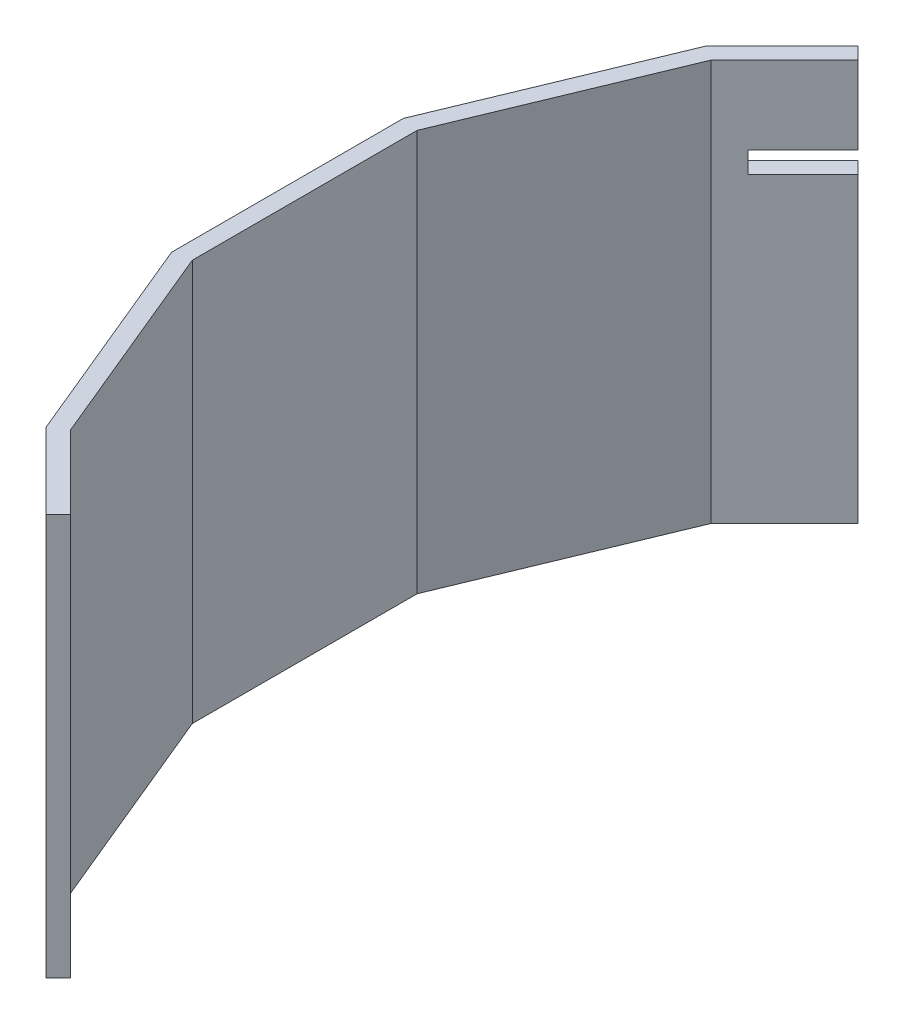
ISO-10303-21;
HEADER;
FILE_DESCRIPTION(('STEP AP214'),'2;1');
FILE_NAME('part.step','',(''),(''),'','','');
FILE_SCHEMA(('AUTOMOTIVE_DESIGN { 1 0 10303 214 1 1 1 1 }'));
ENDSEC;
DATA;
#1=APPLICATION_CONTEXT('core data for automotive mechanical design processes');
#2=APPLICATION_PROTOCOL_DEFINITION('international standard','automotive_design',2000,#1);
#3=PRODUCT_CONTEXT('',#1,'mechanical');
#4=PRODUCT('Part','Part','',(#3));
#5=PRODUCT_RELATED_PRODUCT_CATEGORY('part','',(#4));
#6=PRODUCT_DEFINITION_FORMATION('','',#4);
#7=PRODUCT_DEFINITION_CONTEXT('part definition',#1,'design');
#8=PRODUCT_DEFINITION('design','',#6,#7);
#9=PRODUCT_DEFINITION_SHAPE('','',#8);
#10=(LENGTH_UNIT() NAMED_UNIT(*) SI_UNIT(.MILLI.,.METRE.));
#11=(NAMED_UNIT(*) PLANE_ANGLE_UNIT() SI_UNIT($,.RADIAN.));
#12=(NAMED_UNIT(*) SI_UNIT($,.STERADIAN.) SOLID_ANGLE_UNIT());
#13=UNCERTAINTY_MEASURE_WITH_UNIT(LENGTH_MEASURE(1.E-05),#10,'distance_accuracy_value','');
#14=(GEOMETRIC_REPRESENTATION_CONTEXT(3) GLOBAL_UNCERTAINTY_ASSIGNED_CONTEXT((#13)) GLOBAL_UNIT_ASSIGNED_CONTEXT((#10,
#11,#12)) REPRESENTATION_CONTEXT('',''));
#15=CARTESIAN_POINT('',(0.,0.,0.));
#16=DIRECTION('',(0.,0.,1.));
#17=DIRECTION('',(1.,0.,0.));
#18=AXIS2_PLACEMENT_3D('',#15,#16,#17);
#19=CARTESIAN_POINT('',(-7.07106781186569,465.,7.07106781186566));
#20=DIRECTION('',(0.707106781186549,0.,-0.707106781186546));
#21=DIRECTION('',(-0.707106781186546,0.,-0.707106781186549));
#22=AXIS2_PLACEMENT_3D('',#19,#20,#21);
#23=PLANE('',#22);
#24=DIRECTION('',(0.,-1.,0.));
#25=VECTOR('',#24,1.);
#26=CARTESIAN_POINT('',(-484.368145112784,465.,-470.226009489055));
#27=LINE('',#26,#25);
#28=CARTESIAN_POINT('',(-484.368145112785,350.,-470.226009489055));
#29=VERTEX_POINT('',#28);
#30=CARTESIAN_POINT('',(-484.368145112784,0.,-470.226009489055));
#31=VERTEX_POINT('',#30);
#32=EDGE_CURVE('E223',#29,#31,#27,.T.);
#33=ORIENTED_EDGE('',*,*,#32,.F.);
#34=DIRECTION('',(0.707106781186546,0.,0.707106781186549));
#35=VECTOR('',#34,1.);
#36=CARTESIAN_POINT('',(-7.07106781186569,350.,7.07106781186566));
#37=LINE('',#36,#35);
#38=CARTESIAN_POINT('',(-470.226009489054,350.,-456.083873865324));
#39=VERTEX_POINT('',#38);
#40=EDGE_CURVE('E174',#29,#39,#37,.T.);
#41=ORIENTED_EDGE('',*,*,#40,.T.);
#42=DIRECTION('',(0.,-1.,0.));
#43=VECTOR('',#42,1.);
#44=CARTESIAN_POINT('',(-470.226009489053,465.,-456.083873865324));
#45=LINE('',#44,#43);
#46=CARTESIAN_POINT('',(-470.226009489053,0.,-456.083873865324));
#47=VERTEX_POINT('',#46);
#48=EDGE_CURVE('E107',#39,#47,#45,.T.);
#49=ORIENTED_EDGE('',*,*,#48,.T.);
#50=DIRECTION('',(0.707106781186546,0.,0.707106781186549));
#51=VECTOR('',#50,1.);
#52=CARTESIAN_POINT('',(-7.07106781186569,0.,7.07106781186566));
#53=LINE('',#52,#51);
#54=EDGE_CURVE('E170',#31,#47,#53,.T.);
#55=ORIENTED_EDGE('',*,*,#54,.F.);
#56=EDGE_LOOP('',(#33,#41,#49,#55));
#57=FACE_BOUND('',#56,.T.);
#58=ADVANCED_FACE('F36',(#57),#23,.T.);
#59=CARTESIAN_POINT('',(-477.29707730092,465.,-477.29707730092));
#60=DIRECTION('',(-0.707106781186547,0.,-0.707106781186547));
#61=DIRECTION('',(-0.707106781186548,0.,0.707106781186547));
#62=AXIS2_PLACEMENT_3D('',#59,#60,#61);
#63=PLANE('',#62);
#64=DIRECTION('',(0.,1.,0.));
#65=VECTOR('',#64,1.);
#66=CARTESIAN_POINT('',(-548.007755419574,465.,-406.586399182266));
#67=LINE('',#66,#65);
#68=CARTESIAN_POINT('',(-548.007755419574,350.,-406.586399182266));
#69=VERTEX_POINT('',#68);
#70=CARTESIAN_POINT('',(-548.007755419574,375.,-406.586399182266));
#71=VERTEX_POINT('',#70);
#72=EDGE_CURVE('E292',#69,#71,#67,.T.);
#73=ORIENTED_EDGE('',*,*,#72,.F.);
#74=DIRECTION('',(0.707106781186548,0.,-0.707106781186547));
#75=VECTOR('',#74,1.);
#76=CARTESIAN_POINT('',(-477.29707730092,350.,-477.29707730092));
#77=LINE('',#76,#75);
#78=EDGE_CURVE('E280',#69,#29,#77,.T.);
#79=ORIENTED_EDGE('',*,*,#78,.T.);
#80=ORIENTED_EDGE('',*,*,#32,.T.);
#81=DIRECTION('',(0.707106781186548,0.,-0.707106781186547));
#82=VECTOR('',#81,1.);
#83=CARTESIAN_POINT('',(-477.29707730092,0.,-477.29707730092));
#84=LINE('',#83,#82);
#85=CARTESIAN_POINT('',(-572.237368890237,0.,-382.356785711602));
#86=VERTEX_POINT('',#85);
#87=EDGE_CURVE('E173',#86,#31,#84,.T.);
#88=ORIENTED_EDGE('',*,*,#87,.F.);
#89=DIRECTION('',(0.,-1.,0.));
#90=VECTOR('',#89,1.);
#91=CARTESIAN_POINT('',(-572.237368890237,465.,-382.356785711602));
#92=LINE('',#91,#90);
#93=CARTESIAN_POINT('',(-572.237368890237,465.,-382.356785711602));
#94=VERTEX_POINT('',#93);
#95=EDGE_CURVE('E221',#94,#86,#92,.T.);
#96=ORIENTED_EDGE('',*,*,#95,.F.);
#97=DIRECTION('',(0.707106781186548,0.,-0.707106781186547));
#98=VECTOR('',#97,1.);
#99=CARTESIAN_POINT('',(-477.29707730092,465.,-477.29707730092));
#100=LINE('',#99,#98);
#101=CARTESIAN_POINT('',(-484.368145112784,465.,-470.226009489055));
#102=VERTEX_POINT('',#101);
#103=EDGE_CURVE('E235',#94,#102,#100,.T.);
#104=ORIENTED_EDGE('',*,*,#103,.T.);
#105=CARTESIAN_POINT('',(-484.368145112785,375.,-470.226009489055));
#106=VERTEX_POINT('',#105);
#107=EDGE_CURVE('E115',#102,#106,#27,.T.);
#108=ORIENTED_EDGE('',*,*,#107,.T.);
#109=DIRECTION('',(0.707106781186548,0.,-0.707106781186547));
#110=VECTOR('',#109,1.);
#111=CARTESIAN_POINT('',(-477.29707730092,375.,-477.29707730092));
#112=LINE('',#111,#110);
#113=EDGE_CURVE('E283',#71,#106,#112,.T.);
#114=ORIENTED_EDGE('',*,*,#113,.F.);
#115=EDGE_LOOP('',(#73,#79,#80,#88,#96,#104,#108,#114));
#116=FACE_BOUND('',#115,.T.);
#117=ADVANCED_FACE('F296',(#116),#63,.T.);
#118=CARTESIAN_POINT('',(-463.154941677188,465.,-463.154941677189));
#119=DIRECTION('',(-0.707106781186546,0.,-0.707106781186548));
#120=DIRECTION('',(-0.707106781186549,0.,0.707106781186547));
#121=AXIS2_PLACEMENT_3D('',#118,#119,#120);
#122=PLANE('',#121);
#123=DIRECTION('',(0.707106781186549,0.,-0.707106781186547));
#124=VECTOR('',#123,1.);
#125=CARTESIAN_POINT('',(-463.154941677188,350.,-463.154941677189));
#126=LINE('',#125,#124);
#127=CARTESIAN_POINT('',(-533.865619795843,350.,-392.444263558535));
#128=VERTEX_POINT('',#127);
#129=EDGE_CURVE('E11',#128,#39,#126,.T.);
#130=ORIENTED_EDGE('',*,*,#129,.F.);
#131=DIRECTION('',(0.,-1.,0.));
#132=VECTOR('',#131,1.);
#133=CARTESIAN_POINT('',(-533.865619795843,375.,-392.444263558535));
#134=LINE('',#133,#132);
#135=CARTESIAN_POINT('',(-533.865619795843,375.,-392.444263558535));
#136=VERTEX_POINT('',#135);
#137=EDGE_CURVE('E230',#136,#128,#134,.T.);
#138=ORIENTED_EDGE('',*,*,#137,.F.);
#139=DIRECTION('',(0.707106781186549,0.,-0.707106781186547));
#140=VECTOR('',#139,1.);
#141=CARTESIAN_POINT('',(-463.154941677188,375.,-463.154941677189));
#142=LINE('',#141,#140);
#143=CARTESIAN_POINT('',(-470.226009489053,375.,-456.083873865324));
#144=VERTEX_POINT('',#143);
#145=EDGE_CURVE('E44',#136,#144,#142,.T.);
#146=ORIENTED_EDGE('',*,*,#145,.T.);
#147=CARTESIAN_POINT('',(-470.226009489053,465.,-456.083873865324));
#148=VERTEX_POINT('',#147);
#149=EDGE_CURVE('E201',#148,#144,#45,.T.);
#150=ORIENTED_EDGE('',*,*,#149,.F.);
#151=DIRECTION('',(0.707106781186549,0.,-0.707106781186547));
#152=VECTOR('',#151,1.);
#153=CARTESIAN_POINT('',(-463.154941677188,465.,-463.154941677189));
#154=LINE('',#153,#152);
#155=CARTESIAN_POINT('',(-555.282187589786,465.,-371.027695764592));
#156=VERTEX_POINT('',#155);
#157=EDGE_CURVE('E60',#156,#148,#154,.T.);
#158=ORIENTED_EDGE('',*,*,#157,.F.);
#159=DIRECTION('',(0.,-1.,0.));
#160=VECTOR('',#159,1.);
#161=CARTESIAN_POINT('',(-555.282187589786,465.,-371.027695764592));
#162=LINE('',#161,#160);
#163=CARTESIAN_POINT('',(-555.282187589786,0.,-371.027695764592));
#164=VERTEX_POINT('',#163);
#165=EDGE_CURVE('E156',#156,#164,#162,.T.);
#166=ORIENTED_EDGE('',*,*,#165,.T.);
#167=DIRECTION('',(0.707106781186549,0.,-0.707106781186547));
#168=VECTOR('',#167,1.);
#169=CARTESIAN_POINT('',(-463.154941677188,0.,-463.154941677189));
#170=LINE('',#169,#168);
#171=EDGE_CURVE('E198',#164,#47,#170,.T.);
#172=ORIENTED_EDGE('',*,*,#171,.T.);
#173=ORIENTED_EDGE('',*,*,#48,.F.);
#174=EDGE_LOOP('',(#130,#138,#146,#150,#158,#166,#172,#173));
#175=FACE_BOUND('',#174,.T.);
#176=ADVANCED_FACE('F227',(#175),#122,.F.);
#177=DIRECTION('',(0.707106781186546,0.,0.707106781186549));
#178=VECTOR('',#177,1.);
#179=CARTESIAN_POINT('',(-7.07106781186569,375.,7.07106781186566));
#180=LINE('',#179,#178);
#181=EDGE_CURVE('E51',#106,#144,#180,.T.);
#182=ORIENTED_EDGE('',*,*,#181,.F.);
#183=ORIENTED_EDGE('',*,*,#107,.F.);
#184=DIRECTION('',(0.707106781186546,0.,0.707106781186549));
#185=VECTOR('',#184,1.);
#186=CARTESIAN_POINT('',(-7.07106781186569,465.,7.07106781186566));
#187=LINE('',#186,#185);
#188=EDGE_CURVE('E200',#102,#148,#187,.T.);
#189=ORIENTED_EDGE('',*,*,#188,.T.);
#190=ORIENTED_EDGE('',*,*,#149,.T.);
#191=EDGE_LOOP('',(#182,#183,#189,#190));
#192=FACE_BOUND('',#191,.T.);
#193=ADVANCED_FACE('F38',(#192),#23,.T.);
#194=CARTESIAN_POINT('',(-623.618684445119,465.,-258.311316846436));
#195=DIRECTION('',(0.923879532511287,0.,0.38268343236509));
#196=DIRECTION('',(0.38268343236509,0.,-0.923879532511287));
#197=AXIS2_PLACEMENT_3D('',#194,#195,#196);
#198=PLANE('',#197);
#199=DIRECTION('',(-0.38268343236509,0.,0.923879532511287));
#200=VECTOR('',#199,1.);
#201=CARTESIAN_POINT('',(-623.618684445119,0.,-258.311316846436));
#202=LINE('',#201,#200);
#203=CARTESIAN_POINT('',(-675.,0.,-134.265847981269));
#204=VERTEX_POINT('',#203);
#205=EDGE_CURVE('E177',#86,#204,#202,.T.);
#206=ORIENTED_EDGE('',*,*,#205,.T.);
#207=DIRECTION('',(0.,-1.,0.));
#208=VECTOR('',#207,1.);
#209=CARTESIAN_POINT('',(-675.,465.,-134.265847981269));
#210=LINE('',#209,#208);
#211=CARTESIAN_POINT('',(-675.,465.,-134.265847981269));
#212=VERTEX_POINT('',#211);
#213=EDGE_CURVE('E218',#212,#204,#210,.T.);
#214=ORIENTED_EDGE('',*,*,#213,.F.);
#215=DIRECTION('',(-0.38268343236509,0.,0.923879532511287));
#216=VECTOR('',#215,1.);
#217=CARTESIAN_POINT('',(-623.618684445119,465.,-258.311316846436));
#218=LINE('',#217,#216);
#219=EDGE_CURVE('E237',#94,#212,#218,.T.);
#220=ORIENTED_EDGE('',*,*,#219,.F.);
#221=ORIENTED_EDGE('',*,*,#95,.T.);
#222=EDGE_LOOP('',(#206,#214,#220,#221));
#223=FACE_BOUND('',#222,.T.);
#224=ADVANCED_FACE('F303',(#223),#198,.F.);
#225=CARTESIAN_POINT('',(-675.,465.,0.));
#226=DIRECTION('',(1.,0.,0.));
#227=DIRECTION('',(0.,0.,-1.));
#228=AXIS2_PLACEMENT_3D('',#225,#226,#227);
#229=PLANE('',#228);
#230=DIRECTION('',(0.,0.,1.));
#231=VECTOR('',#230,1.);
#232=CARTESIAN_POINT('',(-675.,0.,0.));
#233=LINE('',#232,#231);
#234=CARTESIAN_POINT('',(-675.,0.,134.265847981269));
#235=VERTEX_POINT('',#234);
#236=EDGE_CURVE('E179',#204,#235,#233,.T.);
#237=ORIENTED_EDGE('',*,*,#236,.T.);
#238=DIRECTION('',(0.,-1.,0.));
#239=VECTOR('',#238,1.);
#240=CARTESIAN_POINT('',(-675.,465.,134.265847981269));
#241=LINE('',#240,#239);
#242=CARTESIAN_POINT('',(-675.,465.,134.265847981269));
#243=VERTEX_POINT('',#242);
#244=EDGE_CURVE('E215',#243,#235,#241,.T.);
#245=ORIENTED_EDGE('',*,*,#244,.F.);
#246=DIRECTION('',(0.,0.,1.));
#247=VECTOR('',#246,1.);
#248=CARTESIAN_POINT('',(-675.,465.,0.));
#249=LINE('',#248,#247);
#250=EDGE_CURVE('E243',#212,#243,#249,.T.);
#251=ORIENTED_EDGE('',*,*,#250,.F.);
#252=ORIENTED_EDGE('',*,*,#213,.T.);
#253=EDGE_LOOP('',(#237,#245,#251,#252));
#254=FACE_BOUND('',#253,.T.);
#255=ADVANCED_FACE('F306',(#254),#229,.F.);
#256=CARTESIAN_POINT('',(-623.618684445118,465.,258.311316846436));
#257=DIRECTION('',(0.923879532511286,0.,-0.382683432365091));
#258=DIRECTION('',(-0.382683432365091,0.,-0.923879532511286));
#259=AXIS2_PLACEMENT_3D('',#256,#257,#258);
#260=PLANE('',#259);
#261=DIRECTION('',(0.382683432365091,0.,0.923879532511287));
#262=VECTOR('',#261,1.);
#263=CARTESIAN_POINT('',(-623.618684445118,0.,258.311316846436));
#264=LINE('',#263,#262);
#265=CARTESIAN_POINT('',(-572.237368890237,0.,382.356785711603));
#266=VERTEX_POINT('',#265);
#267=EDGE_CURVE('E181',#235,#266,#264,.T.);
#268=ORIENTED_EDGE('',*,*,#267,.T.);
#269=DIRECTION('',(0.,-1.,0.));
#270=VECTOR('',#269,1.);
#271=CARTESIAN_POINT('',(-572.237368890237,465.,382.356785711603));
#272=LINE('',#271,#270);
#273=CARTESIAN_POINT('',(-572.237368890237,465.,382.356785711603));
#274=VERTEX_POINT('',#273);
#275=EDGE_CURVE('E212',#274,#266,#272,.T.);
#276=ORIENTED_EDGE('',*,*,#275,.F.);
#277=DIRECTION('',(0.382683432365091,0.,0.923879532511287));
#278=VECTOR('',#277,1.);
#279=CARTESIAN_POINT('',(-623.618684445118,465.,258.311316846436));
#280=LINE('',#279,#278);
#281=EDGE_CURVE('E245',#243,#274,#280,.T.);
#282=ORIENTED_EDGE('',*,*,#281,.F.);
#283=ORIENTED_EDGE('',*,*,#244,.T.);
#284=EDGE_LOOP('',(#268,#276,#282,#283));
#285=FACE_BOUND('',#284,.T.);
#286=ADVANCED_FACE('F351',(#285),#260,.F.);
#287=CARTESIAN_POINT('',(-477.29707730092,465.,477.29707730092));
#288=DIRECTION('',(0.707106781186547,0.,-0.707106781186547));
#289=DIRECTION('',(-0.707106781186547,0.,-0.707106781186548));
#290=AXIS2_PLACEMENT_3D('',#287,#288,#289);
#291=PLANE('',#290);
#292=DIRECTION('',(0.707106781186547,0.,0.707106781186548));
#293=VECTOR('',#292,1.);
#294=CARTESIAN_POINT('',(-477.29707730092,0.,477.29707730092));
#295=LINE('',#294,#293);
#296=CARTESIAN_POINT('',(-484.368145112784,0.,470.226009489055));
#297=VERTEX_POINT('',#296);
#298=EDGE_CURVE('E183',#266,#297,#295,.T.);
#299=ORIENTED_EDGE('',*,*,#298,.T.);
#300=DIRECTION('',(0.,-1.,0.));
#301=VECTOR('',#300,1.);
#302=CARTESIAN_POINT('',(-484.368145112784,465.,470.226009489055));
#303=LINE('',#302,#301);
#304=CARTESIAN_POINT('',(-484.368145112784,465.,470.226009489055));
#305=VERTEX_POINT('',#304);
#306=EDGE_CURVE('E210',#305,#297,#303,.T.);
#307=ORIENTED_EDGE('',*,*,#306,.F.);
#308=DIRECTION('',(0.707106781186547,0.,0.707106781186548));
#309=VECTOR('',#308,1.);
#310=CARTESIAN_POINT('',(-477.29707730092,465.,477.29707730092));
#311=LINE('',#310,#309);
#312=EDGE_CURVE('E247',#274,#305,#311,.T.);
#313=ORIENTED_EDGE('',*,*,#312,.F.);
#314=ORIENTED_EDGE('',*,*,#275,.T.);
#315=EDGE_LOOP('',(#299,#307,#313,#314));
#316=FACE_BOUND('',#315,.T.);
#317=ADVANCED_FACE('F347',(#316),#291,.F.);
#318=CARTESIAN_POINT('',(-7.07106781186569,465.,-7.07106781186566));
#319=DIRECTION('',(0.707106781186549,0.,0.707106781186546));
#320=DIRECTION('',(0.707106781186546,0.,-0.707106781186549));
#321=AXIS2_PLACEMENT_3D('',#318,#319,#320);
#322=PLANE('',#321);
#323=DIRECTION('',(-0.707106781186546,0.,0.707106781186549));
#324=VECTOR('',#323,1.);
#325=CARTESIAN_POINT('',(-7.07106781186569,0.,-7.07106781186566));
#326=LINE('',#325,#324);
#327=CARTESIAN_POINT('',(-470.226009489053,0.,456.083873865324));
#328=VERTEX_POINT('',#327);
#329=EDGE_CURVE('E186',#328,#297,#326,.T.);
#330=ORIENTED_EDGE('',*,*,#329,.F.);
#331=DIRECTION('',(0.,-1.,0.));
#332=VECTOR('',#331,1.);
#333=CARTESIAN_POINT('',(-470.226009489053,465.,456.083873865324));
#334=LINE('',#333,#332);
#335=CARTESIAN_POINT('',(-470.226009489053,465.,456.083873865324));
#336=VERTEX_POINT('',#335);
#337=EDGE_CURVE('E208',#336,#328,#334,.T.);
#338=ORIENTED_EDGE('',*,*,#337,.F.);
#339=DIRECTION('',(-0.707106781186546,0.,0.707106781186549));
#340=VECTOR('',#339,1.);
#341=CARTESIAN_POINT('',(-7.07106781186569,465.,-7.07106781186566));
#342=LINE('',#341,#340);
#343=EDGE_CURVE('E249',#336,#305,#342,.T.);
#344=ORIENTED_EDGE('',*,*,#343,.T.);
#345=ORIENTED_EDGE('',*,*,#306,.T.);
#346=EDGE_LOOP('',(#330,#338,#344,#345));
#347=FACE_BOUND('',#346,.T.);
#348=ADVANCED_FACE('F343',(#347),#322,.T.);
#349=CARTESIAN_POINT('',(-463.154941677188,465.,463.154941677189));
#350=DIRECTION('',(0.707106781186546,0.,-0.707106781186549));
#351=DIRECTION('',(-0.707106781186549,0.,-0.707106781186546));
#352=AXIS2_PLACEMENT_3D('',#349,#350,#351);
#353=PLANE('',#352);
#354=DIRECTION('',(0.707106781186549,0.,0.707106781186546));
#355=VECTOR('',#354,1.);
#356=CARTESIAN_POINT('',(-463.154941677188,0.,463.154941677189));
#357=LINE('',#356,#355);
#358=CARTESIAN_POINT('',(-555.282187589785,0.,371.027695764592));
#359=VERTEX_POINT('',#358);
#360=EDGE_CURVE('E189',#359,#328,#357,.T.);
#361=ORIENTED_EDGE('',*,*,#360,.F.);
#362=DIRECTION('',(0.,-1.,0.));
#363=VECTOR('',#362,1.);
#364=CARTESIAN_POINT('',(-555.282187589785,465.,371.027695764592));
#365=LINE('',#364,#363);
#366=CARTESIAN_POINT('',(-555.282187589785,465.,371.027695764592));
#367=VERTEX_POINT('',#366);
#368=EDGE_CURVE('E206',#367,#359,#365,.T.);
#369=ORIENTED_EDGE('',*,*,#368,.F.);
#370=DIRECTION('',(0.707106781186549,0.,0.707106781186546));
#371=VECTOR('',#370,1.);
#372=CARTESIAN_POINT('',(-463.154941677188,465.,463.154941677189));
#373=LINE('',#372,#371);
#374=EDGE_CURVE('E252',#367,#336,#373,.T.);
#375=ORIENTED_EDGE('',*,*,#374,.T.);
#376=ORIENTED_EDGE('',*,*,#337,.T.);
#377=EDGE_LOOP('',(#361,#369,#375,#376));
#378=FACE_BOUND('',#377,.T.);
#379=ADVANCED_FACE('F340',(#378),#353,.T.);
#380=CARTESIAN_POINT('',(-605.141093794893,465.,250.657648199134));
#381=DIRECTION('',(0.923879532511286,0.,-0.382683432365091));
#382=DIRECTION('',(-0.382683432365091,0.,-0.923879532511286));
#383=AXIS2_PLACEMENT_3D('',#380,#381,#382);
#384=PLANE('',#383);
#385=DIRECTION('',(0.382683432365091,0.,0.923879532511286));
#386=VECTOR('',#385,1.);
#387=CARTESIAN_POINT('',(-605.141093794893,0.,250.657648199134));
#388=LINE('',#387,#386);
#389=CARTESIAN_POINT('',(-655.,0.,130.287600633676));
#390=VERTEX_POINT('',#389);
#391=EDGE_CURVE('E192',#390,#359,#388,.T.);
#392=ORIENTED_EDGE('',*,*,#391,.F.);
#393=DIRECTION('',(0.,-1.,0.));
#394=VECTOR('',#393,1.);
#395=CARTESIAN_POINT('',(-655.,465.,130.287600633676));
#396=LINE('',#395,#394);
#397=CARTESIAN_POINT('',(-655.,465.,130.287600633676));
#398=VERTEX_POINT('',#397);
#399=EDGE_CURVE('E155',#398,#390,#396,.T.);
#400=ORIENTED_EDGE('',*,*,#399,.F.);
#401=DIRECTION('',(0.382683432365091,0.,0.923879532511286));
#402=VECTOR('',#401,1.);
#403=CARTESIAN_POINT('',(-605.141093794893,465.,250.657648199134));
#404=LINE('',#403,#402);
#405=EDGE_CURVE('E163',#398,#367,#404,.T.);
#406=ORIENTED_EDGE('',*,*,#405,.T.);
#407=ORIENTED_EDGE('',*,*,#368,.T.);
#408=EDGE_LOOP('',(#392,#400,#406,#407));
#409=FACE_BOUND('',#408,.T.);
#410=ADVANCED_FACE('F256',(#409),#384,.T.);
#411=CARTESIAN_POINT('',(-655.,465.,0.));
#412=DIRECTION('',(1.,0.,0.));
#413=DIRECTION('',(0.,0.,-1.));
#414=AXIS2_PLACEMENT_3D('',#411,#412,#413);
#415=PLANE('',#414);
#416=DIRECTION('',(0.,0.,1.));
#417=VECTOR('',#416,1.);
#418=CARTESIAN_POINT('',(-655.,0.,0.));
#419=LINE('',#418,#417);
#420=CARTESIAN_POINT('',(-655.,0.,-130.287600633676));
#421=VERTEX_POINT('',#420);
#422=EDGE_CURVE('E150',#421,#390,#419,.T.);
#423=ORIENTED_EDGE('',*,*,#422,.F.);
#424=DIRECTION('',(0.,-1.,0.));
#425=VECTOR('',#424,1.);
#426=CARTESIAN_POINT('',(-655.,465.,-130.287600633676));
#427=LINE('',#426,#425);
#428=CARTESIAN_POINT('',(-655.,465.,-130.287600633676));
#429=VERTEX_POINT('',#428);
#430=EDGE_CURVE('E145',#429,#421,#427,.T.);
#431=ORIENTED_EDGE('',*,*,#430,.F.);
#432=DIRECTION('',(0.,0.,1.));
#433=VECTOR('',#432,1.);
#434=CARTESIAN_POINT('',(-655.,465.,0.));
#435=LINE('',#434,#433);
#436=EDGE_CURVE('E148',#429,#398,#435,.T.);
#437=ORIENTED_EDGE('',*,*,#436,.T.);
#438=ORIENTED_EDGE('',*,*,#399,.T.);
#439=EDGE_LOOP('',(#423,#431,#437,#438));
#440=FACE_BOUND('',#439,.T.);
#441=ADVANCED_FACE('F147',(#440),#415,.T.);
#442=CARTESIAN_POINT('',(-605.141093794893,465.,-250.657648199134));
#443=DIRECTION('',(0.923879532511287,0.,0.38268343236509));
#444=DIRECTION('',(0.38268343236509,0.,-0.923879532511287));
#445=AXIS2_PLACEMENT_3D('',#442,#443,#444);
#446=PLANE('',#445);
#447=DIRECTION('',(-0.38268343236509,0.,0.923879532511287));
#448=VECTOR('',#447,1.);
#449=CARTESIAN_POINT('',(-605.141093794893,0.,-250.657648199134));
#450=LINE('',#449,#448);
#451=EDGE_CURVE('E196',#164,#421,#450,.T.);
#452=ORIENTED_EDGE('',*,*,#451,.F.);
#453=ORIENTED_EDGE('',*,*,#165,.F.);
#454=DIRECTION('',(-0.38268343236509,0.,0.923879532511287));
#455=VECTOR('',#454,1.);
#456=CARTESIAN_POINT('',(-605.141093794893,465.,-250.657648199134));
#457=LINE('',#456,#455);
#458=EDGE_CURVE('E160',#156,#429,#457,.T.);
#459=ORIENTED_EDGE('',*,*,#458,.T.);
#460=ORIENTED_EDGE('',*,*,#430,.T.);
#461=EDGE_LOOP('',(#452,#453,#459,#460));
#462=FACE_BOUND('',#461,.T.);
#463=ADVANCED_FACE('F165',(#462),#446,.T.);
#464=CARTESIAN_POINT('',(0.,465.,0.));
#465=DIRECTION('',(0.,1.,0.));
#466=DIRECTION('',(0.,0.,1.));
#467=AXIS2_PLACEMENT_3D('',#464,#465,#466);
#468=PLANE('',#467);
#469=ORIENTED_EDGE('',*,*,#188,.F.);
#470=ORIENTED_EDGE('',*,*,#103,.F.);
#471=ORIENTED_EDGE('',*,*,#219,.T.);
#472=ORIENTED_EDGE('',*,*,#250,.T.);
#473=ORIENTED_EDGE('',*,*,#281,.T.);
#474=ORIENTED_EDGE('',*,*,#312,.T.);
#475=ORIENTED_EDGE('',*,*,#343,.F.);
#476=ORIENTED_EDGE('',*,*,#374,.F.);
#477=ORIENTED_EDGE('',*,*,#405,.F.);
#478=ORIENTED_EDGE('',*,*,#436,.F.);
#479=ORIENTED_EDGE('',*,*,#458,.F.);
#480=ORIENTED_EDGE('',*,*,#157,.T.);
#481=EDGE_LOOP('',(#469,#470,#471,#472,#473,#474,#475,#476,#477,#478,#479,#480));
#482=FACE_BOUND('',#481,.T.);
#483=ADVANCED_FACE('F159',(#482),#468,.T.);
#484=CARTESIAN_POINT('',(0.,0.,0.));
#485=DIRECTION('',(0.,1.,0.));
#486=DIRECTION('',(0.,0.,1.));
#487=AXIS2_PLACEMENT_3D('',#484,#485,#486);
#488=PLANE('',#487);
#489=ORIENTED_EDGE('',*,*,#54,.T.);
#490=ORIENTED_EDGE('',*,*,#171,.F.);
#491=ORIENTED_EDGE('',*,*,#451,.T.);
#492=ORIENTED_EDGE('',*,*,#422,.T.);
#493=ORIENTED_EDGE('',*,*,#391,.T.);
#494=ORIENTED_EDGE('',*,*,#360,.T.);
#495=ORIENTED_EDGE('',*,*,#329,.T.);
#496=ORIENTED_EDGE('',*,*,#298,.F.);
#497=ORIENTED_EDGE('',*,*,#267,.F.);
#498=ORIENTED_EDGE('',*,*,#236,.F.);
#499=ORIENTED_EDGE('',*,*,#205,.F.);
#500=ORIENTED_EDGE('',*,*,#87,.T.);
#501=EDGE_LOOP('',(#489,#490,#491,#492,#493,#494,#495,#496,#497,#498,#499,#500));
#502=FACE_BOUND('',#501,.T.);
#503=ADVANCED_FACE('F259',(#502),#488,.F.);
#504=CARTESIAN_POINT('',(-434.870670429726,350.,-548.007755419575));
#505=DIRECTION('',(0.,1.,0.));
#506=DIRECTION('',(0.,0.,1.));
#507=AXIS2_PLACEMENT_3D('',#504,#505,#506);
#508=PLANE('',#507);
#509=ORIENTED_EDGE('',*,*,#78,.F.);
#510=DIRECTION('',(0.707106781186547,0.,0.707106781186548));
#511=VECTOR('',#510,1.);
#512=CARTESIAN_POINT('',(-562.149891043305,350.,-420.728534805997));
#513=LINE('',#512,#511);
#514=EDGE_CURVE('E277',#69,#128,#513,.T.);
#515=ORIENTED_EDGE('',*,*,#514,.T.);
#516=ORIENTED_EDGE('',*,*,#129,.T.);
#517=ORIENTED_EDGE('',*,*,#40,.F.);
#518=EDGE_LOOP('',(#509,#515,#516,#517));
#519=FACE_BOUND('',#518,.T.);
#520=ADVANCED_FACE('F278',(#519),#508,.T.);
#521=CARTESIAN_POINT('',(-562.149891043305,375.,-420.728534805997));
#522=DIRECTION('',(-0.707106781186548,0.,0.707106781186547));
#523=DIRECTION('',(0.707106781186547,0.,0.707106781186548));
#524=AXIS2_PLACEMENT_3D('',#521,#522,#523);
#525=PLANE('',#524);
#526=ORIENTED_EDGE('',*,*,#72,.T.);
#527=DIRECTION('',(0.707106781186547,0.,0.707106781186548));
#528=VECTOR('',#527,1.);
#529=CARTESIAN_POINT('',(-562.149891043305,375.,-420.728534805997));
#530=LINE('',#529,#528);
#531=EDGE_CURVE('E284',#71,#136,#530,.T.);
#532=ORIENTED_EDGE('',*,*,#531,.T.);
#533=ORIENTED_EDGE('',*,*,#137,.T.);
#534=ORIENTED_EDGE('',*,*,#514,.F.);
#535=EDGE_LOOP('',(#526,#532,#533,#534));
#536=FACE_BOUND('',#535,.T.);
#537=ADVANCED_FACE('F286',(#536),#525,.F.);
#538=CARTESIAN_POINT('',(-434.870670429726,375.,-548.007755419575));
#539=DIRECTION('',(0.,1.,0.));
#540=DIRECTION('',(0.,0.,1.));
#541=AXIS2_PLACEMENT_3D('',#538,#539,#540);
#542=PLANE('',#541);
#543=ORIENTED_EDGE('',*,*,#181,.T.);
#544=ORIENTED_EDGE('',*,*,#145,.F.);
#545=ORIENTED_EDGE('',*,*,#531,.F.);
#546=ORIENTED_EDGE('',*,*,#113,.T.);
#547=EDGE_LOOP('',(#543,#544,#545,#546));
#548=FACE_BOUND('',#547,.T.);
#549=ADVANCED_FACE('F311',(#548),#542,.F.);
#550=CLOSED_SHELL('',(#58,#117,#176,#193,#224,#255,#286,#317,#348,#379,#410,#441,#463,#483,#503,
#520,#537,#549));
#551=MANIFOLD_SOLID_BREP('B2',#550);
#552=ADVANCED_BREP_SHAPE_REPRESENTATION('',(#18,#551),#14);
#553=SHAPE_DEFINITION_REPRESENTATION(#9,#552);
ENDSEC;
END-ISO-10303-21;
